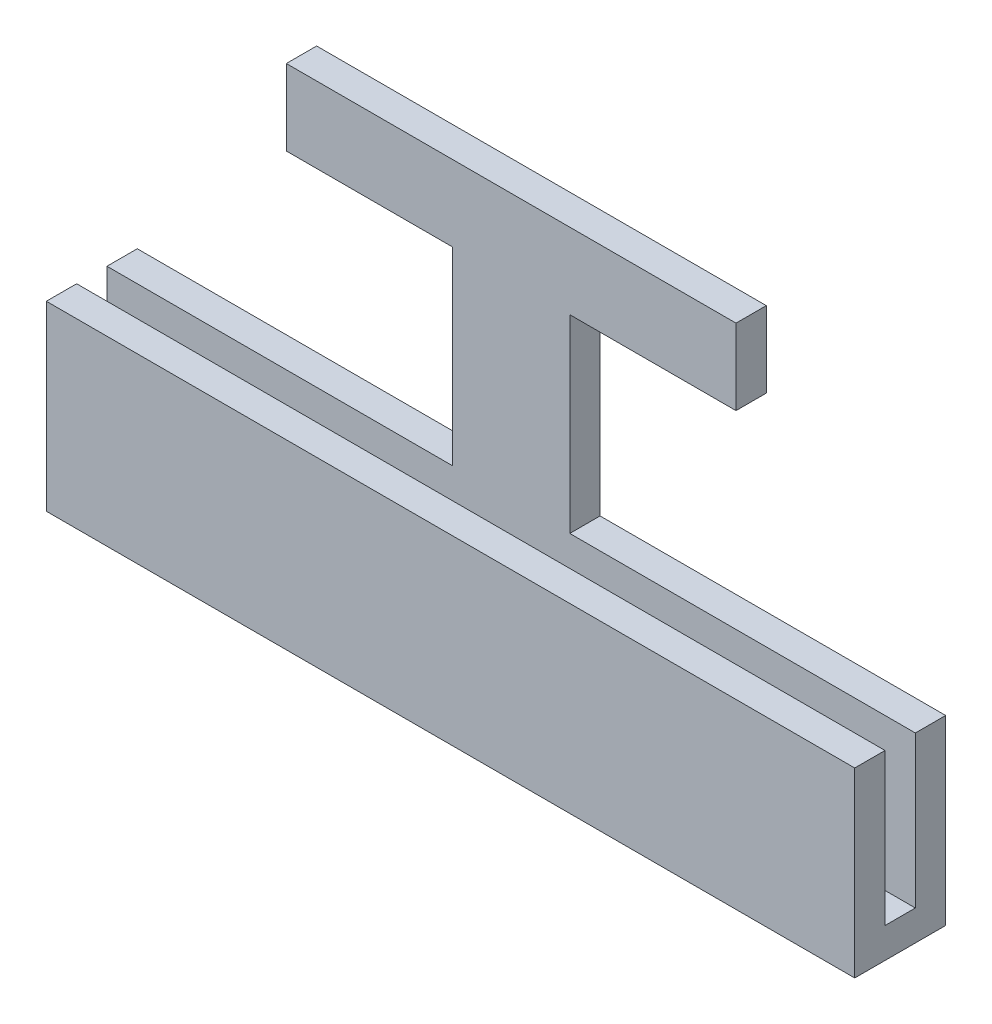
ISO-10303-21;
HEADER;
FILE_DESCRIPTION(('STEP AP214'),'2;1');
FILE_NAME('part.step','',(''),(''),'','','');
FILE_SCHEMA(('AUTOMOTIVE_DESIGN { 1 0 10303 214 1 1 1 1 }'));
ENDSEC;
DATA;
#1=APPLICATION_CONTEXT('core data for automotive mechanical design processes');
#2=APPLICATION_PROTOCOL_DEFINITION('international standard','automotive_design',2000,#1);
#3=PRODUCT_CONTEXT('',#1,'mechanical');
#4=PRODUCT('Part','Part','',(#3));
#5=PRODUCT_RELATED_PRODUCT_CATEGORY('part','',(#4));
#6=PRODUCT_DEFINITION_FORMATION('','',#4);
#7=PRODUCT_DEFINITION_CONTEXT('part definition',#1,'design');
#8=PRODUCT_DEFINITION('design','',#6,#7);
#9=PRODUCT_DEFINITION_SHAPE('','',#8);
#10=(LENGTH_UNIT() NAMED_UNIT(*) SI_UNIT(.MILLI.,.METRE.));
#11=(NAMED_UNIT(*) PLANE_ANGLE_UNIT() SI_UNIT($,.RADIAN.));
#12=(NAMED_UNIT(*) SI_UNIT($,.STERADIAN.) SOLID_ANGLE_UNIT());
#13=UNCERTAINTY_MEASURE_WITH_UNIT(LENGTH_MEASURE(1.E-05),#10,'distance_accuracy_value','');
#14=(GEOMETRIC_REPRESENTATION_CONTEXT(3) GLOBAL_UNCERTAINTY_ASSIGNED_CONTEXT((#13)) GLOBAL_UNIT_ASSIGNED_CONTEXT((#10,
#11,#12)) REPRESENTATION_CONTEXT('',''));
#15=CARTESIAN_POINT('',(0.,0.,0.));
#16=DIRECTION('',(0.,0.,1.));
#17=DIRECTION('',(1.,0.,0.));
#18=AXIS2_PLACEMENT_3D('',#15,#16,#17);
#19=CARTESIAN_POINT('',(0.,-7.5,0.));
#20=DIRECTION('',(0.,1.,0.));
#21=DIRECTION('',(0.,0.,1.));
#22=AXIS2_PLACEMENT_3D('',#19,#20,#21);
#23=PLANE('',#22);
#24=DIRECTION('',(0.,0.,-1.));
#25=VECTOR('',#24,1.);
#26=CARTESIAN_POINT('',(40.,-7.5,0.));
#27=LINE('',#26,#25);
#28=CARTESIAN_POINT('',(40.,-7.5,0.));
#29=VERTEX_POINT('',#28);
#30=CARTESIAN_POINT('',(40.,-7.50000000000001,-3.));
#31=VERTEX_POINT('',#30);
#32=EDGE_CURVE('E107',#29,#31,#27,.T.);
#33=ORIENTED_EDGE('',*,*,#32,.T.);
#34=DIRECTION('',(-1.,0.,0.));
#35=VECTOR('',#34,1.);
#36=CARTESIAN_POINT('',(-40.,-7.5,-3.));
#37=LINE('',#36,#35);
#38=CARTESIAN_POINT('',(-40.,-7.5,-3.));
#39=VERTEX_POINT('',#38);
#40=EDGE_CURVE('E112',#31,#39,#37,.T.);
#41=ORIENTED_EDGE('',*,*,#40,.T.);
#42=DIRECTION('',(0.,0.,-1.));
#43=VECTOR('',#42,1.);
#44=CARTESIAN_POINT('',(-40.,-7.5,0.));
#45=LINE('',#44,#43);
#46=CARTESIAN_POINT('',(-40.,-7.50000000000001,0.));
#47=VERTEX_POINT('',#46);
#48=EDGE_CURVE('E111',#47,#39,#45,.T.);
#49=ORIENTED_EDGE('',*,*,#48,.F.);
#50=DIRECTION('',(1.,0.,0.));
#51=VECTOR('',#50,1.);
#52=CARTESIAN_POINT('',(40.,-7.5,0.));
#53=LINE('',#52,#51);
#54=EDGE_CURVE('E91',#47,#29,#53,.T.);
#55=ORIENTED_EDGE('',*,*,#54,.T.);
#56=EDGE_LOOP('',(#33,#41,#49,#55));
#57=FACE_BOUND('',#56,.T.);
#58=ADVANCED_FACE('F33',(#57),#23,.T.);
#59=CARTESIAN_POINT('',(-40.,-7.50000000000001,3.));
#60=DIRECTION('',(1.,0.,0.));
#61=DIRECTION('',(0.,0.,-1.));
#62=AXIS2_PLACEMENT_3D('',#59,#60,#61);
#63=PLANE('',#62);
#64=DIRECTION('',(0.,-1.,0.));
#65=VECTOR('',#64,1.);
#66=CARTESIAN_POINT('',(-40.,-7.50000000000001,0.));
#67=LINE('',#66,#65);
#68=CARTESIAN_POINT('',(-40.,7.49999999999999,0.));
#69=VERTEX_POINT('',#68);
#70=EDGE_CURVE('E86',#69,#47,#67,.T.);
#71=ORIENTED_EDGE('',*,*,#70,.T.);
#72=ORIENTED_EDGE('',*,*,#48,.T.);
#73=DIRECTION('',(0.,1.,0.));
#74=VECTOR('',#73,1.);
#75=CARTESIAN_POINT('',(-40.,-7.5,-3.));
#76=LINE('',#75,#74);
#77=CARTESIAN_POINT('',(-40.,7.5,-3.));
#78=VERTEX_POINT('',#77);
#79=EDGE_CURVE('E48',#39,#78,#76,.T.);
#80=ORIENTED_EDGE('',*,*,#79,.T.);
#81=DIRECTION('',(0.,0.,1.));
#82=VECTOR('',#81,1.);
#83=CARTESIAN_POINT('',(-40.,7.5,-6.));
#84=LINE('',#83,#82);
#85=CARTESIAN_POINT('',(-40.,7.5,-6.));
#86=VERTEX_POINT('',#85);
#87=EDGE_CURVE('E113',#86,#78,#84,.T.);
#88=ORIENTED_EDGE('',*,*,#87,.F.);
#89=DIRECTION('',(0.,1.,0.));
#90=VECTOR('',#89,1.);
#91=CARTESIAN_POINT('',(-40.,-10.5,-5.99999999999998));
#92=LINE('',#91,#90);
#93=CARTESIAN_POINT('',(-40.,-10.5,-5.99999999999998));
#94=VERTEX_POINT('',#93);
#95=EDGE_CURVE('E92',#94,#86,#92,.T.);
#96=ORIENTED_EDGE('',*,*,#95,.F.);
#97=DIRECTION('',(0.,0.,-1.));
#98=VECTOR('',#97,1.);
#99=CARTESIAN_POINT('',(-40.,-10.5,0.));
#100=LINE('',#99,#98);
#101=CARTESIAN_POINT('',(-40.,-10.5,3.00000000000001));
#102=VERTEX_POINT('',#101);
#103=EDGE_CURVE('E115',#102,#94,#100,.T.);
#104=ORIENTED_EDGE('',*,*,#103,.F.);
#105=DIRECTION('',(0.,-1.,0.));
#106=VECTOR('',#105,1.);
#107=CARTESIAN_POINT('',(-40.,-7.50000000000001,3.));
#108=LINE('',#107,#106);
#109=CARTESIAN_POINT('',(-40.,7.49999999999999,3.));
#110=VERTEX_POINT('',#109);
#111=EDGE_CURVE('E80',#110,#102,#108,.T.);
#112=ORIENTED_EDGE('',*,*,#111,.F.);
#113=DIRECTION('',(0.,0.,-1.));
#114=VECTOR('',#113,1.);
#115=CARTESIAN_POINT('',(-40.,7.49999999999999,3.));
#116=LINE('',#115,#114);
#117=EDGE_CURVE('E41',#110,#69,#116,.T.);
#118=ORIENTED_EDGE('',*,*,#117,.T.);
#119=EDGE_LOOP('',(#71,#72,#80,#88,#96,#104,#112,#118));
#120=FACE_BOUND('',#119,.T.);
#121=ADVANCED_FACE('F35',(#120),#63,.F.);
#122=CARTESIAN_POINT('',(40.,-7.5,3.));
#123=DIRECTION('',(-1.,0.,0.));
#124=DIRECTION('',(0.,0.,1.));
#125=AXIS2_PLACEMENT_3D('',#122,#123,#124);
#126=PLANE('',#125);
#127=DIRECTION('',(0.,1.,0.));
#128=VECTOR('',#127,1.);
#129=CARTESIAN_POINT('',(40.,-7.5,0.));
#130=LINE('',#129,#128);
#131=CARTESIAN_POINT('',(40.,7.5,0.));
#132=VERTEX_POINT('',#131);
#133=EDGE_CURVE('E81',#29,#132,#130,.T.);
#134=ORIENTED_EDGE('',*,*,#133,.T.);
#135=DIRECTION('',(0.,0.,-1.));
#136=VECTOR('',#135,1.);
#137=CARTESIAN_POINT('',(40.,7.5,3.));
#138=LINE('',#137,#136);
#139=CARTESIAN_POINT('',(40.,7.5,3.));
#140=VERTEX_POINT('',#139);
#141=EDGE_CURVE('E11',#140,#132,#138,.T.);
#142=ORIENTED_EDGE('',*,*,#141,.F.);
#143=DIRECTION('',(0.,1.,0.));
#144=VECTOR('',#143,1.);
#145=CARTESIAN_POINT('',(40.,-7.5,3.));
#146=LINE('',#145,#144);
#147=CARTESIAN_POINT('',(40.,-10.5,3.));
#148=VERTEX_POINT('',#147);
#149=EDGE_CURVE('E126',#148,#140,#146,.T.);
#150=ORIENTED_EDGE('',*,*,#149,.F.);
#151=DIRECTION('',(0.,0.,-1.));
#152=VECTOR('',#151,1.);
#153=CARTESIAN_POINT('',(40.,-10.5,0.));
#154=LINE('',#153,#152);
#155=CARTESIAN_POINT('',(40.,-10.5,-5.99999999999999));
#156=VERTEX_POINT('',#155);
#157=EDGE_CURVE('E135',#148,#156,#154,.T.);
#158=ORIENTED_EDGE('',*,*,#157,.T.);
#159=DIRECTION('',(0.,1.,0.));
#160=VECTOR('',#159,1.);
#161=CARTESIAN_POINT('',(40.,-10.5,-5.99999999999999));
#162=LINE('',#161,#160);
#163=CARTESIAN_POINT('',(40.,7.49999999999999,-6.));
#164=VERTEX_POINT('',#163);
#165=EDGE_CURVE('E96',#156,#164,#162,.T.);
#166=ORIENTED_EDGE('',*,*,#165,.T.);
#167=DIRECTION('',(0.,0.,1.));
#168=VECTOR('',#167,1.);
#169=CARTESIAN_POINT('',(40.,7.49999999999999,-6.));
#170=LINE('',#169,#168);
#171=CARTESIAN_POINT('',(40.,7.49999999999999,-3.));
#172=VERTEX_POINT('',#171);
#173=EDGE_CURVE('E183',#164,#172,#170,.T.);
#174=ORIENTED_EDGE('',*,*,#173,.T.);
#175=DIRECTION('',(0.,-1.,0.));
#176=VECTOR('',#175,1.);
#177=CARTESIAN_POINT('',(40.,-7.50000000000001,-3.));
#178=LINE('',#177,#176);
#179=EDGE_CURVE('E189',#172,#31,#178,.T.);
#180=ORIENTED_EDGE('',*,*,#179,.T.);
#181=ORIENTED_EDGE('',*,*,#32,.F.);
#182=EDGE_LOOP('',(#134,#142,#150,#158,#166,#174,#180,#181));
#183=FACE_BOUND('',#182,.T.);
#184=ADVANCED_FACE('F103',(#183),#126,.F.);
#185=CARTESIAN_POINT('',(40.,7.5,3.));
#186=DIRECTION('',(0.,-1.,0.));
#187=DIRECTION('',(1.,0.,0.));
#188=AXIS2_PLACEMENT_3D('',#185,#186,#187);
#189=PLANE('',#188);
#190=DIRECTION('',(-1.,0.,0.));
#191=VECTOR('',#190,1.);
#192=CARTESIAN_POINT('',(40.,7.5,0.));
#193=LINE('',#192,#191);
#194=EDGE_CURVE('E72',#132,#69,#193,.T.);
#195=ORIENTED_EDGE('',*,*,#194,.T.);
#196=ORIENTED_EDGE('',*,*,#117,.F.);
#197=DIRECTION('',(-1.,0.,0.));
#198=VECTOR('',#197,1.);
#199=CARTESIAN_POINT('',(40.,7.5,3.));
#200=LINE('',#199,#198);
#201=EDGE_CURVE('E57',#140,#110,#200,.T.);
#202=ORIENTED_EDGE('',*,*,#201,.F.);
#203=ORIENTED_EDGE('',*,*,#141,.T.);
#204=EDGE_LOOP('',(#195,#196,#202,#203));
#205=FACE_BOUND('',#204,.T.);
#206=ADVANCED_FACE('F74',(#205),#189,.F.);
#207=CARTESIAN_POINT('',(0.,0.,3.));
#208=DIRECTION('',(0.,0.,1.));
#209=DIRECTION('',(1.,0.,0.));
#210=AXIS2_PLACEMENT_3D('',#207,#208,#209);
#211=PLANE('',#210);
#212=ORIENTED_EDGE('',*,*,#111,.T.);
#213=DIRECTION('',(-1.,0.,0.));
#214=VECTOR('',#213,1.);
#215=CARTESIAN_POINT('',(0.,-10.5,3.00000000000001));
#216=LINE('',#215,#214);
#217=EDGE_CURVE('E131',#148,#102,#216,.T.);
#218=ORIENTED_EDGE('',*,*,#217,.F.);
#219=ORIENTED_EDGE('',*,*,#149,.T.);
#220=ORIENTED_EDGE('',*,*,#201,.T.);
#221=EDGE_LOOP('',(#212,#218,#219,#220));
#222=FACE_BOUND('',#221,.T.);
#223=ADVANCED_FACE('F128',(#222),#211,.T.);
#224=CARTESIAN_POINT('',(0.,0.,0.));
#225=DIRECTION('',(0.,0.,1.));
#226=DIRECTION('',(1.,0.,0.));
#227=AXIS2_PLACEMENT_3D('',#224,#225,#226);
#228=PLANE('',#227);
#229=ORIENTED_EDGE('',*,*,#70,.F.);
#230=ORIENTED_EDGE('',*,*,#194,.F.);
#231=ORIENTED_EDGE('',*,*,#133,.F.);
#232=ORIENTED_EDGE('',*,*,#54,.F.);
#233=EDGE_LOOP('',(#229,#230,#231,#232));
#234=FACE_BOUND('',#233,.T.);
#235=ADVANCED_FACE('F89',(#234),#228,.F.);
#236=CARTESIAN_POINT('',(0.,-10.5,-5.99999999999999));
#237=DIRECTION('',(0.,0.,-1.));
#238=DIRECTION('',(-1.,0.,0.));
#239=AXIS2_PLACEMENT_3D('',#236,#237,#238);
#240=PLANE('',#239);
#241=ORIENTED_EDGE('',*,*,#95,.T.);
#242=DIRECTION('',(1.,0.,0.));
#243=VECTOR('',#242,1.);
#244=CARTESIAN_POINT('',(-40.,7.5,-6.));
#245=LINE('',#244,#243);
#246=CARTESIAN_POINT('',(-5.80000000000001,7.5,-6.));
#247=VERTEX_POINT('',#246);
#248=EDGE_CURVE('E188',#86,#247,#245,.T.);
#249=ORIENTED_EDGE('',*,*,#248,.T.);
#250=DIRECTION('',(0.,1.,0.));
#251=VECTOR('',#250,1.);
#252=CARTESIAN_POINT('',(-5.80000000000001,26.25,-6.));
#253=LINE('',#252,#251);
#254=CARTESIAN_POINT('',(-5.80000000000001,26.25,-6.));
#255=VERTEX_POINT('',#254);
#256=EDGE_CURVE('E238',#247,#255,#253,.T.);
#257=ORIENTED_EDGE('',*,*,#256,.T.);
#258=DIRECTION('',(-1.,0.,0.));
#259=VECTOR('',#258,1.);
#260=CARTESIAN_POINT('',(-22.25,26.25,-6.));
#261=LINE('',#260,#259);
#262=CARTESIAN_POINT('',(-22.25,26.25,-6.));
#263=VERTEX_POINT('',#262);
#264=EDGE_CURVE('E235',#255,#263,#261,.T.);
#265=ORIENTED_EDGE('',*,*,#264,.T.);
#266=DIRECTION('',(0.,1.,0.));
#267=VECTOR('',#266,1.);
#268=CARTESIAN_POINT('',(-22.25,26.25,-6.));
#269=LINE('',#268,#267);
#270=CARTESIAN_POINT('',(-22.25,33.75,-6.));
#271=VERTEX_POINT('',#270);
#272=EDGE_CURVE('E232',#263,#271,#269,.T.);
#273=ORIENTED_EDGE('',*,*,#272,.T.);
#274=DIRECTION('',(1.,0.,0.));
#275=VECTOR('',#274,1.);
#276=CARTESIAN_POINT('',(-22.25,33.75,-6.));
#277=LINE('',#276,#275);
#278=CARTESIAN_POINT('',(22.25,33.75,-6.));
#279=VERTEX_POINT('',#278);
#280=EDGE_CURVE('E229',#271,#279,#277,.T.);
#281=ORIENTED_EDGE('',*,*,#280,.T.);
#282=DIRECTION('',(0.,-1.,0.));
#283=VECTOR('',#282,1.);
#284=CARTESIAN_POINT('',(22.25,26.25,-6.));
#285=LINE('',#284,#283);
#286=CARTESIAN_POINT('',(22.25,26.25,-6.));
#287=VERTEX_POINT('',#286);
#288=EDGE_CURVE('E226',#279,#287,#285,.T.);
#289=ORIENTED_EDGE('',*,*,#288,.T.);
#290=DIRECTION('',(-1.,0.,0.));
#291=VECTOR('',#290,1.);
#292=CARTESIAN_POINT('',(5.79999999999999,26.25,-6.));
#293=LINE('',#292,#291);
#294=CARTESIAN_POINT('',(5.79999999999999,26.25,-6.));
#295=VERTEX_POINT('',#294);
#296=EDGE_CURVE('E223',#287,#295,#293,.T.);
#297=ORIENTED_EDGE('',*,*,#296,.T.);
#298=DIRECTION('',(0.,-1.,0.));
#299=VECTOR('',#298,1.);
#300=CARTESIAN_POINT('',(5.79999999999999,26.25,-6.));
#301=LINE('',#300,#299);
#302=CARTESIAN_POINT('',(5.79999999999999,7.5,-6.));
#303=VERTEX_POINT('',#302);
#304=EDGE_CURVE('E220',#295,#303,#301,.T.);
#305=ORIENTED_EDGE('',*,*,#304,.T.);
#306=DIRECTION('',(1.,0.,0.));
#307=VECTOR('',#306,1.);
#308=CARTESIAN_POINT('',(5.79999999999999,7.5,-6.));
#309=LINE('',#308,#307);
#310=EDGE_CURVE('E186',#303,#164,#309,.T.);
#311=ORIENTED_EDGE('',*,*,#310,.T.);
#312=ORIENTED_EDGE('',*,*,#165,.F.);
#313=DIRECTION('',(-1.,0.,0.));
#314=VECTOR('',#313,1.);
#315=CARTESIAN_POINT('',(0.,-10.5,-5.99999999999999));
#316=LINE('',#315,#314);
#317=EDGE_CURVE('E121',#156,#94,#316,.T.);
#318=ORIENTED_EDGE('',*,*,#317,.T.);
#319=EDGE_LOOP('',(#241,#249,#257,#265,#273,#281,#289,#297,#305,#311,#312,#318));
#320=FACE_BOUND('',#319,.T.);
#321=ADVANCED_FACE('F156',(#320),#240,.T.);
#322=CARTESIAN_POINT('',(0.,-10.5,0.));
#323=DIRECTION('',(0.,1.,0.));
#324=DIRECTION('',(0.,0.,1.));
#325=AXIS2_PLACEMENT_3D('',#322,#323,#324);
#326=PLANE('',#325);
#327=ORIENTED_EDGE('',*,*,#103,.T.);
#328=ORIENTED_EDGE('',*,*,#317,.F.);
#329=ORIENTED_EDGE('',*,*,#157,.F.);
#330=ORIENTED_EDGE('',*,*,#217,.T.);
#331=EDGE_LOOP('',(#327,#328,#329,#330));
#332=FACE_BOUND('',#331,.T.);
#333=ADVANCED_FACE('F148',(#332),#326,.F.);
#334=CARTESIAN_POINT('',(-40.,7.5,-6.));
#335=DIRECTION('',(0.,-1.,0.));
#336=DIRECTION('',(1.,0.,0.));
#337=AXIS2_PLACEMENT_3D('',#334,#335,#336);
#338=PLANE('',#337);
#339=DIRECTION('',(1.,0.,0.));
#340=VECTOR('',#339,1.);
#341=CARTESIAN_POINT('',(-40.,7.5,-3.));
#342=LINE('',#341,#340);
#343=CARTESIAN_POINT('',(-5.80000000000001,7.5,-3.));
#344=VERTEX_POINT('',#343);
#345=EDGE_CURVE('E215',#78,#344,#342,.T.);
#346=ORIENTED_EDGE('',*,*,#345,.T.);
#347=DIRECTION('',(0.,0.,1.));
#348=VECTOR('',#347,1.);
#349=CARTESIAN_POINT('',(-5.80000000000001,7.5,-6.));
#350=LINE('',#349,#348);
#351=EDGE_CURVE('E118',#247,#344,#350,.T.);
#352=ORIENTED_EDGE('',*,*,#351,.F.);
#353=ORIENTED_EDGE('',*,*,#248,.F.);
#354=ORIENTED_EDGE('',*,*,#87,.T.);
#355=EDGE_LOOP('',(#346,#352,#353,#354));
#356=FACE_BOUND('',#355,.T.);
#357=ADVANCED_FACE('F248',(#356),#338,.F.);
#358=CARTESIAN_POINT('',(-5.80000000000001,26.25,-6.));
#359=DIRECTION('',(1.,0.,0.));
#360=DIRECTION('',(0.,0.,-1.));
#361=AXIS2_PLACEMENT_3D('',#358,#359,#360);
#362=PLANE('',#361);
#363=DIRECTION('',(0.,1.,0.));
#364=VECTOR('',#363,1.);
#365=CARTESIAN_POINT('',(-5.80000000000001,26.25,-3.));
#366=LINE('',#365,#364);
#367=CARTESIAN_POINT('',(-5.80000000000001,26.25,-3.));
#368=VERTEX_POINT('',#367);
#369=EDGE_CURVE('E212',#344,#368,#366,.T.);
#370=ORIENTED_EDGE('',*,*,#369,.T.);
#371=DIRECTION('',(0.,0.,1.));
#372=VECTOR('',#371,1.);
#373=CARTESIAN_POINT('',(-5.80000000000001,26.25,-6.));
#374=LINE('',#373,#372);
#375=EDGE_CURVE('E162',#255,#368,#374,.T.);
#376=ORIENTED_EDGE('',*,*,#375,.F.);
#377=ORIENTED_EDGE('',*,*,#256,.F.);
#378=ORIENTED_EDGE('',*,*,#351,.T.);
#379=EDGE_LOOP('',(#370,#376,#377,#378));
#380=FACE_BOUND('',#379,.T.);
#381=ADVANCED_FACE('F252',(#380),#362,.F.);
#382=CARTESIAN_POINT('',(-22.25,26.25,-6.));
#383=DIRECTION('',(0.,1.,0.));
#384=DIRECTION('',(0.,0.,1.));
#385=AXIS2_PLACEMENT_3D('',#382,#383,#384);
#386=PLANE('',#385);
#387=DIRECTION('',(-1.,0.,0.));
#388=VECTOR('',#387,1.);
#389=CARTESIAN_POINT('',(-22.25,26.25,-3.));
#390=LINE('',#389,#388);
#391=CARTESIAN_POINT('',(-22.25,26.25,-3.));
#392=VERTEX_POINT('',#391);
#393=EDGE_CURVE('E209',#368,#392,#390,.T.);
#394=ORIENTED_EDGE('',*,*,#393,.T.);
#395=DIRECTION('',(0.,0.,1.));
#396=VECTOR('',#395,1.);
#397=CARTESIAN_POINT('',(-22.25,26.25,-6.));
#398=LINE('',#397,#396);
#399=EDGE_CURVE('E165',#263,#392,#398,.T.);
#400=ORIENTED_EDGE('',*,*,#399,.F.);
#401=ORIENTED_EDGE('',*,*,#264,.F.);
#402=ORIENTED_EDGE('',*,*,#375,.T.);
#403=EDGE_LOOP('',(#394,#400,#401,#402));
#404=FACE_BOUND('',#403,.T.);
#405=ADVANCED_FACE('F260',(#404),#386,.F.);
#406=CARTESIAN_POINT('',(-22.25,26.25,-6.));
#407=DIRECTION('',(1.,0.,0.));
#408=DIRECTION('',(0.,0.,-1.));
#409=AXIS2_PLACEMENT_3D('',#406,#407,#408);
#410=PLANE('',#409);
#411=DIRECTION('',(0.,1.,0.));
#412=VECTOR('',#411,1.);
#413=CARTESIAN_POINT('',(-22.25,26.25,-3.));
#414=LINE('',#413,#412);
#415=CARTESIAN_POINT('',(-22.25,33.75,-3.));
#416=VERTEX_POINT('',#415);
#417=EDGE_CURVE('E206',#392,#416,#414,.T.);
#418=ORIENTED_EDGE('',*,*,#417,.T.);
#419=DIRECTION('',(0.,0.,1.));
#420=VECTOR('',#419,1.);
#421=CARTESIAN_POINT('',(-22.25,33.75,-6.));
#422=LINE('',#421,#420);
#423=EDGE_CURVE('E168',#271,#416,#422,.T.);
#424=ORIENTED_EDGE('',*,*,#423,.F.);
#425=ORIENTED_EDGE('',*,*,#272,.F.);
#426=ORIENTED_EDGE('',*,*,#399,.T.);
#427=EDGE_LOOP('',(#418,#424,#425,#426));
#428=FACE_BOUND('',#427,.T.);
#429=ADVANCED_FACE('F365',(#428),#410,.F.);
#430=CARTESIAN_POINT('',(-22.25,33.75,-6.));
#431=DIRECTION('',(0.,-1.,0.));
#432=DIRECTION('',(1.,0.,0.));
#433=AXIS2_PLACEMENT_3D('',#430,#431,#432);
#434=PLANE('',#433);
#435=DIRECTION('',(1.,0.,0.));
#436=VECTOR('',#435,1.);
#437=CARTESIAN_POINT('',(-22.25,33.75,-3.));
#438=LINE('',#437,#436);
#439=CARTESIAN_POINT('',(22.25,33.75,-3.));
#440=VERTEX_POINT('',#439);
#441=EDGE_CURVE('E203',#416,#440,#438,.T.);
#442=ORIENTED_EDGE('',*,*,#441,.T.);
#443=DIRECTION('',(0.,0.,1.));
#444=VECTOR('',#443,1.);
#445=CARTESIAN_POINT('',(22.25,33.75,-6.));
#446=LINE('',#445,#444);
#447=EDGE_CURVE('E171',#279,#440,#446,.T.);
#448=ORIENTED_EDGE('',*,*,#447,.F.);
#449=ORIENTED_EDGE('',*,*,#280,.F.);
#450=ORIENTED_EDGE('',*,*,#423,.T.);
#451=EDGE_LOOP('',(#442,#448,#449,#450));
#452=FACE_BOUND('',#451,.T.);
#453=ADVANCED_FACE('F372',(#452),#434,.F.);
#454=CARTESIAN_POINT('',(22.25,26.25,-6.));
#455=DIRECTION('',(-1.,0.,0.));
#456=DIRECTION('',(0.,0.,1.));
#457=AXIS2_PLACEMENT_3D('',#454,#455,#456);
#458=PLANE('',#457);
#459=DIRECTION('',(0.,-1.,0.));
#460=VECTOR('',#459,1.);
#461=CARTESIAN_POINT('',(22.25,26.25,-3.));
#462=LINE('',#461,#460);
#463=CARTESIAN_POINT('',(22.25,26.25,-3.));
#464=VERTEX_POINT('',#463);
#465=EDGE_CURVE('E200',#440,#464,#462,.T.);
#466=ORIENTED_EDGE('',*,*,#465,.T.);
#467=DIRECTION('',(0.,0.,1.));
#468=VECTOR('',#467,1.);
#469=CARTESIAN_POINT('',(22.25,26.25,-6.));
#470=LINE('',#469,#468);
#471=EDGE_CURVE('E174',#287,#464,#470,.T.);
#472=ORIENTED_EDGE('',*,*,#471,.F.);
#473=ORIENTED_EDGE('',*,*,#288,.F.);
#474=ORIENTED_EDGE('',*,*,#447,.T.);
#475=EDGE_LOOP('',(#466,#472,#473,#474));
#476=FACE_BOUND('',#475,.T.);
#477=ADVANCED_FACE('F380',(#476),#458,.F.);
#478=CARTESIAN_POINT('',(5.79999999999999,26.25,-6.));
#479=DIRECTION('',(0.,1.,0.));
#480=DIRECTION('',(-1.,0.,0.));
#481=AXIS2_PLACEMENT_3D('',#478,#479,#480);
#482=PLANE('',#481);
#483=DIRECTION('',(-1.,0.,0.));
#484=VECTOR('',#483,1.);
#485=CARTESIAN_POINT('',(5.79999999999999,26.25,-3.));
#486=LINE('',#485,#484);
#487=CARTESIAN_POINT('',(5.79999999999999,26.25,-3.));
#488=VERTEX_POINT('',#487);
#489=EDGE_CURVE('E197',#464,#488,#486,.T.);
#490=ORIENTED_EDGE('',*,*,#489,.T.);
#491=DIRECTION('',(0.,0.,1.));
#492=VECTOR('',#491,1.);
#493=CARTESIAN_POINT('',(5.79999999999999,26.25,-6.));
#494=LINE('',#493,#492);
#495=EDGE_CURVE('E177',#295,#488,#494,.T.);
#496=ORIENTED_EDGE('',*,*,#495,.F.);
#497=ORIENTED_EDGE('',*,*,#296,.F.);
#498=ORIENTED_EDGE('',*,*,#471,.T.);
#499=EDGE_LOOP('',(#490,#496,#497,#498));
#500=FACE_BOUND('',#499,.T.);
#501=ADVANCED_FACE('F388',(#500),#482,.F.);
#502=CARTESIAN_POINT('',(5.79999999999999,26.25,-6.));
#503=DIRECTION('',(-1.,0.,0.));
#504=DIRECTION('',(0.,0.,1.));
#505=AXIS2_PLACEMENT_3D('',#502,#503,#504);
#506=PLANE('',#505);
#507=DIRECTION('',(0.,-1.,0.));
#508=VECTOR('',#507,1.);
#509=CARTESIAN_POINT('',(5.79999999999999,26.25,-3.));
#510=LINE('',#509,#508);
#511=CARTESIAN_POINT('',(5.79999999999999,7.5,-3.));
#512=VERTEX_POINT('',#511);
#513=EDGE_CURVE('E194',#488,#512,#510,.T.);
#514=ORIENTED_EDGE('',*,*,#513,.T.);
#515=DIRECTION('',(0.,0.,1.));
#516=VECTOR('',#515,1.);
#517=CARTESIAN_POINT('',(5.79999999999999,7.5,-6.));
#518=LINE('',#517,#516);
#519=EDGE_CURVE('E180',#303,#512,#518,.T.);
#520=ORIENTED_EDGE('',*,*,#519,.F.);
#521=ORIENTED_EDGE('',*,*,#304,.F.);
#522=ORIENTED_EDGE('',*,*,#495,.T.);
#523=EDGE_LOOP('',(#514,#520,#521,#522));
#524=FACE_BOUND('',#523,.T.);
#525=ADVANCED_FACE('F304',(#524),#506,.F.);
#526=CARTESIAN_POINT('',(5.79999999999999,7.5,-6.));
#527=DIRECTION('',(0.,-1.,0.));
#528=DIRECTION('',(1.,0.,0.));
#529=AXIS2_PLACEMENT_3D('',#526,#527,#528);
#530=PLANE('',#529);
#531=DIRECTION('',(1.,0.,0.));
#532=VECTOR('',#531,1.);
#533=CARTESIAN_POINT('',(5.79999999999999,7.5,-3.));
#534=LINE('',#533,#532);
#535=EDGE_CURVE('E191',#512,#172,#534,.T.);
#536=ORIENTED_EDGE('',*,*,#535,.T.);
#537=ORIENTED_EDGE('',*,*,#173,.F.);
#538=ORIENTED_EDGE('',*,*,#310,.F.);
#539=ORIENTED_EDGE('',*,*,#519,.T.);
#540=EDGE_LOOP('',(#536,#537,#538,#539));
#541=FACE_BOUND('',#540,.T.);
#542=ADVANCED_FACE('F299',(#541),#530,.F.);
#543=CARTESIAN_POINT('',(0.,0.,-3.));
#544=DIRECTION('',(0.,0.,-1.));
#545=DIRECTION('',(-1.,0.,0.));
#546=AXIS2_PLACEMENT_3D('',#543,#544,#545);
#547=PLANE('',#546);
#548=ORIENTED_EDGE('',*,*,#79,.F.);
#549=ORIENTED_EDGE('',*,*,#40,.F.);
#550=ORIENTED_EDGE('',*,*,#179,.F.);
#551=ORIENTED_EDGE('',*,*,#535,.F.);
#552=ORIENTED_EDGE('',*,*,#513,.F.);
#553=ORIENTED_EDGE('',*,*,#489,.F.);
#554=ORIENTED_EDGE('',*,*,#465,.F.);
#555=ORIENTED_EDGE('',*,*,#441,.F.);
#556=ORIENTED_EDGE('',*,*,#417,.F.);
#557=ORIENTED_EDGE('',*,*,#393,.F.);
#558=ORIENTED_EDGE('',*,*,#369,.F.);
#559=ORIENTED_EDGE('',*,*,#345,.F.);
#560=EDGE_LOOP('',(#548,#549,#550,#551,#552,#553,#554,#555,#556,#557,#558,#559));
#561=FACE_BOUND('',#560,.T.);
#562=ADVANCED_FACE('F297',(#561),#547,.F.);
#563=CLOSED_SHELL('',(#58,#121,#184,#206,#223,#235,#321,#333,#357,#381,#405,#429,#453,#477,#501,
#525,#542,#562));
#564=MANIFOLD_SOLID_BREP('B2',#563);
#565=ADVANCED_BREP_SHAPE_REPRESENTATION('',(#18,#564),#14);
#566=SHAPE_DEFINITION_REPRESENTATION(#9,#565);
ENDSEC;
END-ISO-10303-21;
